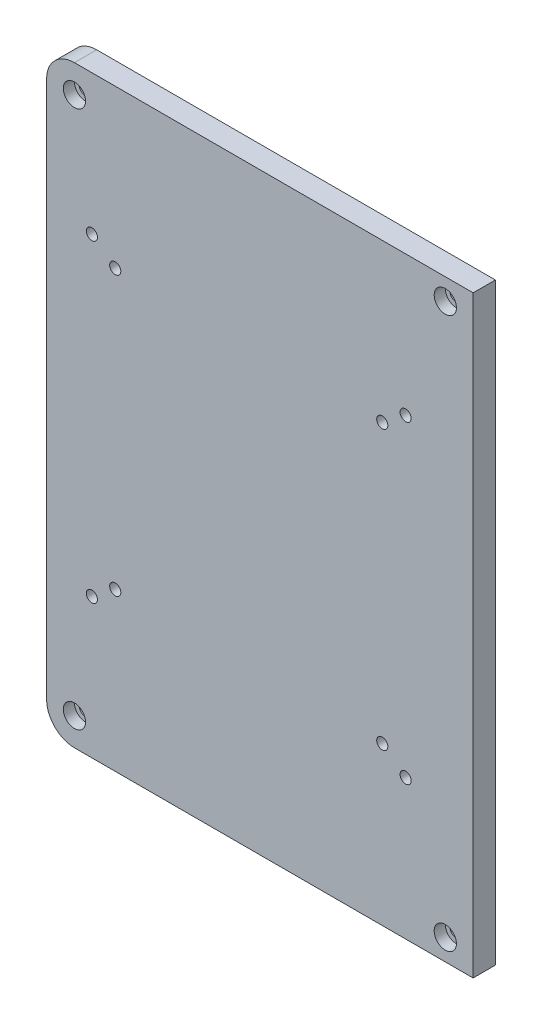
ISO-10303-21;
HEADER;
FILE_DESCRIPTION(('STEP AP214'),'2;1');
FILE_NAME('part.step','',(''),(''),'','','');
FILE_SCHEMA(('AUTOMOTIVE_DESIGN { 1 0 10303 214 1 1 1 1 }'));
ENDSEC;
DATA;
#1=APPLICATION_CONTEXT('core data for automotive mechanical design processes');
#2=APPLICATION_PROTOCOL_DEFINITION('international standard','automotive_design',2000,#1);
#3=PRODUCT_CONTEXT('',#1,'mechanical');
#4=PRODUCT('Part','Part','',(#3));
#5=PRODUCT_RELATED_PRODUCT_CATEGORY('part','',(#4));
#6=PRODUCT_DEFINITION_FORMATION('','',#4);
#7=PRODUCT_DEFINITION_CONTEXT('part definition',#1,'design');
#8=PRODUCT_DEFINITION('design','',#6,#7);
#9=PRODUCT_DEFINITION_SHAPE('','',#8);
#10=(LENGTH_UNIT() NAMED_UNIT(*) SI_UNIT(.MILLI.,.METRE.));
#11=(NAMED_UNIT(*) PLANE_ANGLE_UNIT() SI_UNIT($,.RADIAN.));
#12=(NAMED_UNIT(*) SI_UNIT($,.STERADIAN.) SOLID_ANGLE_UNIT());
#13=UNCERTAINTY_MEASURE_WITH_UNIT(LENGTH_MEASURE(1.E-05),#10,'distance_accuracy_value','');
#14=(GEOMETRIC_REPRESENTATION_CONTEXT(3) GLOBAL_UNCERTAINTY_ASSIGNED_CONTEXT((#13)) GLOBAL_UNIT_ASSIGNED_CONTEXT((#10,
#11,#12)) REPRESENTATION_CONTEXT('',''));
#15=CARTESIAN_POINT('',(0.,0.,0.));
#16=DIRECTION('',(0.,0.,1.));
#17=DIRECTION('',(1.,0.,0.));
#18=AXIS2_PLACEMENT_3D('',#15,#16,#17);
#19=CARTESIAN_POINT('',(-107.5,72.5,-4.));
#20=DIRECTION('',(0.,0.,1.));
#21=DIRECTION('',(1.,0.,0.));
#22=AXIS2_PLACEMENT_3D('',#19,#20,#21);
#23=CYLINDRICAL_SURFACE('',#22,1.75);
#24=CARTESIAN_POINT('',(-107.5,72.5,0.));
#25=DIRECTION('',(0.,0.,1.));
#26=DIRECTION('',(1.,0.,0.));
#27=AXIS2_PLACEMENT_3D('',#24,#25,#26);
#28=CIRCLE('',#27,1.75);
#29=CARTESIAN_POINT('',(-105.75,72.5,0.));
#30=VERTEX_POINT('',#29);
#31=EDGE_CURVE('E140',#30,#30,#28,.T.);
#32=ORIENTED_EDGE('',*,*,#31,.F.);
#33=EDGE_LOOP('',(#32));
#34=FACE_BOUND('',#33,.T.);
#35=CARTESIAN_POINT('',(-107.5,72.5,3.));
#36=DIRECTION('',(0.,0.,1.));
#37=DIRECTION('',(1.,0.,0.));
#38=AXIS2_PLACEMENT_3D('',#35,#36,#37);
#39=CIRCLE('',#38,1.75);
#40=CARTESIAN_POINT('',(-105.75,72.5,3.));
#41=VERTEX_POINT('',#40);
#42=EDGE_CURVE('E37',#41,#41,#39,.F.);
#43=ORIENTED_EDGE('',*,*,#42,.F.);
#44=EDGE_LOOP('',(#43));
#45=FACE_BOUND('',#44,.T.);
#46=ADVANCED_FACE('F33',(#34,#45),#23,.F.);
#47=CARTESIAN_POINT('',(-7.50000000000003,-74.25,-4.94974746830584));
#48=DIRECTION('',(0.,0.,1.));
#49=DIRECTION('',(1.,0.,0.));
#50=AXIS2_PLACEMENT_3D('',#47,#48,#49);
#51=CYLINDRICAL_SURFACE('',#50,1.75);
#52=CARTESIAN_POINT('',(-7.50000000000003,-74.25,0.));
#53=DIRECTION('',(0.,0.,1.));
#54=DIRECTION('',(1.,0.,0.));
#55=AXIS2_PLACEMENT_3D('',#52,#53,#54);
#56=CIRCLE('',#55,1.75);
#57=CARTESIAN_POINT('',(-5.75000000000003,-74.25,0.));
#58=VERTEX_POINT('',#57);
#59=EDGE_CURVE('E100',#58,#58,#56,.F.);
#60=ORIENTED_EDGE('',*,*,#59,.T.);
#61=EDGE_LOOP('',(#60));
#62=FACE_BOUND('',#61,.T.);
#63=CARTESIAN_POINT('',(-7.50000000000003,-74.25,3.));
#64=DIRECTION('',(0.,0.,1.));
#65=DIRECTION('',(1.,0.,0.));
#66=AXIS2_PLACEMENT_3D('',#63,#64,#65);
#67=CIRCLE('',#66,1.75);
#68=CARTESIAN_POINT('',(-5.75000000000003,-74.25,3.));
#69=VERTEX_POINT('',#68);
#70=EDGE_CURVE('E151',#69,#69,#67,.F.);
#71=ORIENTED_EDGE('',*,*,#70,.F.);
#72=EDGE_LOOP('',(#71));
#73=FACE_BOUND('',#72,.T.);
#74=ADVANCED_FACE('F239',(#62,#73),#51,.F.);
#75=CARTESIAN_POINT('',(-7.50000000000003,74.25,-4.94974746830584));
#76=DIRECTION('',(0.,0.,1.));
#77=DIRECTION('',(1.,0.,0.));
#78=AXIS2_PLACEMENT_3D('',#75,#76,#77);
#79=CYLINDRICAL_SURFACE('',#78,1.75);
#80=CARTESIAN_POINT('',(-7.50000000000003,74.25,0.));
#81=DIRECTION('',(0.,0.,1.));
#82=DIRECTION('',(1.,0.,0.));
#83=AXIS2_PLACEMENT_3D('',#80,#81,#82);
#84=CIRCLE('',#83,1.75);
#85=CARTESIAN_POINT('',(-5.75000000000003,74.25,0.));
#86=VERTEX_POINT('',#85);
#87=EDGE_CURVE('E147',#86,#86,#84,.F.);
#88=ORIENTED_EDGE('',*,*,#87,.T.);
#89=EDGE_LOOP('',(#88));
#90=FACE_BOUND('',#89,.T.);
#91=CARTESIAN_POINT('',(-7.50000000000003,74.25,3.));
#92=DIRECTION('',(0.,0.,1.));
#93=DIRECTION('',(1.,0.,0.));
#94=AXIS2_PLACEMENT_3D('',#91,#92,#93);
#95=CIRCLE('',#94,1.75);
#96=CARTESIAN_POINT('',(-5.75000000000003,74.25,3.));
#97=VERTEX_POINT('',#96);
#98=EDGE_CURVE('E149',#97,#97,#95,.F.);
#99=ORIENTED_EDGE('',*,*,#98,.F.);
#100=EDGE_LOOP('',(#99));
#101=FACE_BOUND('',#100,.T.);
#102=ADVANCED_FACE('F245',(#90,#101),#79,.F.);
#103=CARTESIAN_POINT('',(-107.5,-72.5,-4.));
#104=DIRECTION('',(0.,0.,1.));
#105=DIRECTION('',(1.,0.,0.));
#106=AXIS2_PLACEMENT_3D('',#103,#104,#105);
#107=CYLINDRICAL_SURFACE('',#106,1.75);
#108=CARTESIAN_POINT('',(-107.5,-72.5,0.));
#109=DIRECTION('',(0.,0.,1.));
#110=DIRECTION('',(1.,0.,0.));
#111=AXIS2_PLACEMENT_3D('',#108,#109,#110);
#112=CIRCLE('',#111,1.75);
#113=CARTESIAN_POINT('',(-105.75,-72.5,0.));
#114=VERTEX_POINT('',#113);
#115=EDGE_CURVE('E124',#114,#114,#112,.T.);
#116=ORIENTED_EDGE('',*,*,#115,.F.);
#117=EDGE_LOOP('',(#116));
#118=FACE_BOUND('',#117,.T.);
#119=CARTESIAN_POINT('',(-107.5,-72.5,3.));
#120=DIRECTION('',(0.,0.,1.));
#121=DIRECTION('',(1.,0.,0.));
#122=AXIS2_PLACEMENT_3D('',#119,#120,#121);
#123=CIRCLE('',#122,1.75);
#124=CARTESIAN_POINT('',(-105.75,-72.5,3.));
#125=VERTEX_POINT('',#124);
#126=EDGE_CURVE('E144',#125,#125,#123,.F.);
#127=ORIENTED_EDGE('',*,*,#126,.F.);
#128=EDGE_LOOP('',(#127));
#129=FACE_BOUND('',#128,.T.);
#130=ADVANCED_FACE('F252',(#118,#129),#107,.F.);
#131=CARTESIAN_POINT('',(-107.5,-72.5,6.));
#132=DIRECTION('',(0.,0.,-1.));
#133=DIRECTION('',(-1.,0.,0.));
#134=AXIS2_PLACEMENT_3D('',#131,#132,#133);
#135=CYLINDRICAL_SURFACE('',#134,7.5);
#136=CARTESIAN_POINT('',(-107.5,-72.5,0.));
#137=DIRECTION('',(0.,0.,1.));
#138=DIRECTION('',(1.,0.,0.));
#139=AXIS2_PLACEMENT_3D('',#136,#137,#138);
#140=CIRCLE('',#139,7.5);
#141=CARTESIAN_POINT('',(-115.,-72.5,0.));
#142=VERTEX_POINT('',#141);
#143=CARTESIAN_POINT('',(-107.5,-80.,0.));
#144=VERTEX_POINT('',#143);
#145=EDGE_CURVE('E121',#142,#144,#140,.T.);
#146=ORIENTED_EDGE('',*,*,#145,.T.);
#147=DIRECTION('',(0.,0.,-1.));
#148=VECTOR('',#147,1.);
#149=CARTESIAN_POINT('',(-107.5,-80.,6.));
#150=LINE('',#149,#148);
#151=CARTESIAN_POINT('',(-107.5,-80.,6.));
#152=VERTEX_POINT('',#151);
#153=EDGE_CURVE('E42',#152,#144,#150,.T.);
#154=ORIENTED_EDGE('',*,*,#153,.F.);
#155=CARTESIAN_POINT('',(-107.5,-72.5,6.));
#156=DIRECTION('',(0.,0.,1.));
#157=DIRECTION('',(1.,0.,0.));
#158=AXIS2_PLACEMENT_3D('',#155,#156,#157);
#159=CIRCLE('',#158,7.5);
#160=CARTESIAN_POINT('',(-115.,-72.5,6.));
#161=VERTEX_POINT('',#160);
#162=EDGE_CURVE('E109',#161,#152,#159,.T.);
#163=ORIENTED_EDGE('',*,*,#162,.F.);
#164=DIRECTION('',(0.,0.,-1.));
#165=VECTOR('',#164,1.);
#166=CARTESIAN_POINT('',(-115.,-72.5,6.));
#167=LINE('',#166,#165);
#168=EDGE_CURVE('E120',#161,#142,#167,.T.);
#169=ORIENTED_EDGE('',*,*,#168,.T.);
#170=EDGE_LOOP('',(#146,#154,#163,#169));
#171=FACE_BOUND('',#170,.T.);
#172=ADVANCED_FACE('F35',(#171),#135,.T.);
#173=CARTESIAN_POINT('',(-107.5,-80.,6.));
#174=DIRECTION('',(0.,1.,0.));
#175=DIRECTION('',(0.,0.,1.));
#176=AXIS2_PLACEMENT_3D('',#173,#174,#175);
#177=PLANE('',#176);
#178=DIRECTION('',(1.,0.,0.));
#179=VECTOR('',#178,1.);
#180=CARTESIAN_POINT('',(-107.5,-80.,0.));
#181=LINE('',#180,#179);
#182=CARTESIAN_POINT('',(0.,-80.,0.));
#183=VERTEX_POINT('',#182);
#184=EDGE_CURVE('E104',#144,#183,#181,.T.);
#185=ORIENTED_EDGE('',*,*,#184,.T.);
#186=DIRECTION('',(0.,0.,1.));
#187=VECTOR('',#186,1.);
#188=CARTESIAN_POINT('',(0.,-80.,-4.));
#189=LINE('',#188,#187);
#190=CARTESIAN_POINT('',(0.,-80.,6.));
#191=VERTEX_POINT('',#190);
#192=EDGE_CURVE('E50',#183,#191,#189,.T.);
#193=ORIENTED_EDGE('',*,*,#192,.T.);
#194=DIRECTION('',(1.,0.,0.));
#195=VECTOR('',#194,1.);
#196=CARTESIAN_POINT('',(-107.5,-80.,6.));
#197=LINE('',#196,#195);
#198=EDGE_CURVE('E86',#152,#191,#197,.T.);
#199=ORIENTED_EDGE('',*,*,#198,.F.);
#200=ORIENTED_EDGE('',*,*,#153,.T.);
#201=EDGE_LOOP('',(#185,#193,#199,#200));
#202=FACE_BOUND('',#201,.T.);
#203=ADVANCED_FACE('F103',(#202),#177,.F.);
#204=CARTESIAN_POINT('',(-107.5,80.,6.));
#205=DIRECTION('',(0.,-1.,0.));
#206=DIRECTION('',(0.,0.,-1.));
#207=AXIS2_PLACEMENT_3D('',#204,#205,#206);
#208=PLANE('',#207);
#209=DIRECTION('',(-1.,0.,0.));
#210=VECTOR('',#209,1.);
#211=CARTESIAN_POINT('',(-107.5,80.,6.));
#212=LINE('',#211,#210);
#213=CARTESIAN_POINT('',(0.,80.,6.));
#214=VERTEX_POINT('',#213);
#215=CARTESIAN_POINT('',(-107.5,80.,6.));
#216=VERTEX_POINT('',#215);
#217=EDGE_CURVE('E111',#214,#216,#212,.T.);
#218=ORIENTED_EDGE('',*,*,#217,.F.);
#219=DIRECTION('',(0.,0.,1.));
#220=VECTOR('',#219,1.);
#221=CARTESIAN_POINT('',(0.,80.,-4.));
#222=LINE('',#221,#220);
#223=CARTESIAN_POINT('',(0.,80.,0.));
#224=VERTEX_POINT('',#223);
#225=EDGE_CURVE('E98',#224,#214,#222,.T.);
#226=ORIENTED_EDGE('',*,*,#225,.F.);
#227=DIRECTION('',(-1.,0.,0.));
#228=VECTOR('',#227,1.);
#229=CARTESIAN_POINT('',(-107.5,80.,0.));
#230=LINE('',#229,#228);
#231=CARTESIAN_POINT('',(-107.5,80.,0.));
#232=VERTEX_POINT('',#231);
#233=EDGE_CURVE('E126',#224,#232,#230,.T.);
#234=ORIENTED_EDGE('',*,*,#233,.T.);
#235=DIRECTION('',(0.,0.,-1.));
#236=VECTOR('',#235,1.);
#237=CARTESIAN_POINT('',(-107.5,80.,6.));
#238=LINE('',#237,#236);
#239=EDGE_CURVE('E134',#216,#232,#238,.T.);
#240=ORIENTED_EDGE('',*,*,#239,.F.);
#241=EDGE_LOOP('',(#218,#226,#234,#240));
#242=FACE_BOUND('',#241,.T.);
#243=ADVANCED_FACE('F327',(#242),#208,.F.);
#244=CARTESIAN_POINT('',(-107.5,72.5,6.));
#245=DIRECTION('',(0.,0.,-1.));
#246=DIRECTION('',(-1.,0.,0.));
#247=AXIS2_PLACEMENT_3D('',#244,#245,#246);
#248=CYLINDRICAL_SURFACE('',#247,7.49999999999999);
#249=CARTESIAN_POINT('',(-107.5,72.5,0.));
#250=DIRECTION('',(0.,0.,1.));
#251=DIRECTION('',(1.,0.,0.));
#252=AXIS2_PLACEMENT_3D('',#249,#250,#251);
#253=CIRCLE('',#252,7.49999999999999);
#254=CARTESIAN_POINT('',(-115.,72.5,0.));
#255=VERTEX_POINT('',#254);
#256=EDGE_CURVE('E128',#232,#255,#253,.T.);
#257=ORIENTED_EDGE('',*,*,#256,.T.);
#258=DIRECTION('',(0.,0.,-1.));
#259=VECTOR('',#258,1.);
#260=CARTESIAN_POINT('',(-115.,72.5,6.));
#261=LINE('',#260,#259);
#262=CARTESIAN_POINT('',(-115.,72.5,6.));
#263=VERTEX_POINT('',#262);
#264=EDGE_CURVE('E132',#263,#255,#261,.T.);
#265=ORIENTED_EDGE('',*,*,#264,.F.);
#266=CARTESIAN_POINT('',(-107.5,72.5,6.));
#267=DIRECTION('',(0.,0.,1.));
#268=DIRECTION('',(1.,0.,0.));
#269=AXIS2_PLACEMENT_3D('',#266,#267,#268);
#270=CIRCLE('',#269,7.49999999999999);
#271=EDGE_CURVE('E113',#216,#263,#270,.T.);
#272=ORIENTED_EDGE('',*,*,#271,.F.);
#273=ORIENTED_EDGE('',*,*,#239,.T.);
#274=EDGE_LOOP('',(#257,#265,#272,#273));
#275=FACE_BOUND('',#274,.T.);
#276=ADVANCED_FACE('F233',(#275),#248,.T.);
#277=CARTESIAN_POINT('',(-115.,72.5,6.));
#278=DIRECTION('',(1.,0.,0.));
#279=DIRECTION('',(0.,0.,-1.));
#280=AXIS2_PLACEMENT_3D('',#277,#278,#279);
#281=PLANE('',#280);
#282=DIRECTION('',(0.,-1.,0.));
#283=VECTOR('',#282,1.);
#284=CARTESIAN_POINT('',(-115.,72.5,0.));
#285=LINE('',#284,#283);
#286=EDGE_CURVE('E79',#255,#142,#285,.T.);
#287=ORIENTED_EDGE('',*,*,#286,.T.);
#288=ORIENTED_EDGE('',*,*,#168,.F.);
#289=DIRECTION('',(0.,-1.,0.));
#290=VECTOR('',#289,1.);
#291=CARTESIAN_POINT('',(-115.,72.5,6.));
#292=LINE('',#291,#290);
#293=EDGE_CURVE('E58',#263,#161,#292,.T.);
#294=ORIENTED_EDGE('',*,*,#293,.F.);
#295=ORIENTED_EDGE('',*,*,#264,.T.);
#296=EDGE_LOOP('',(#287,#288,#294,#295));
#297=FACE_BOUND('',#296,.T.);
#298=ADVANCED_FACE('F224',(#297),#281,.F.);
#299=CARTESIAN_POINT('',(-107.5,-72.5,6.));
#300=DIRECTION('',(0.,0.,1.));
#301=DIRECTION('',(1.,0.,0.));
#302=AXIS2_PLACEMENT_3D('',#299,#300,#301);
#303=PLANE('',#302);
#304=CARTESIAN_POINT('',(-7.50000000000003,-74.25,6.));
#305=DIRECTION('',(0.,0.,1.));
#306=DIRECTION('',(1.,0.,0.));
#307=AXIS2_PLACEMENT_3D('',#304,#305,#306);
#308=CIRCLE('',#307,3.);
#309=CARTESIAN_POINT('',(-4.50000000000003,-74.25,6.));
#310=VERTEX_POINT('',#309);
#311=EDGE_CURVE('E474',#310,#310,#308,.T.);
#312=ORIENTED_EDGE('',*,*,#311,.F.);
#313=EDGE_LOOP('',(#312));
#314=FACE_BOUND('',#313,.T.);
#315=CARTESIAN_POINT('',(-7.50000000000003,74.25,6.));
#316=DIRECTION('',(0.,0.,1.));
#317=DIRECTION('',(1.,0.,0.));
#318=AXIS2_PLACEMENT_3D('',#315,#316,#317);
#319=CIRCLE('',#318,3.);
#320=CARTESIAN_POINT('',(-4.50000000000003,74.25,6.));
#321=VERTEX_POINT('',#320);
#322=EDGE_CURVE('E466',#321,#321,#319,.T.);
#323=ORIENTED_EDGE('',*,*,#322,.F.);
#324=EDGE_LOOP('',(#323));
#325=FACE_BOUND('',#324,.T.);
#326=CARTESIAN_POINT('',(-107.5,72.5,6.));
#327=DIRECTION('',(0.,0.,1.));
#328=DIRECTION('',(1.,0.,0.));
#329=AXIS2_PLACEMENT_3D('',#326,#327,#328);
#330=CIRCLE('',#329,3.00000000000001);
#331=CARTESIAN_POINT('',(-104.5,72.5,6.));
#332=VERTEX_POINT('',#331);
#333=EDGE_CURVE('E464',#332,#332,#330,.T.);
#334=ORIENTED_EDGE('',*,*,#333,.F.);
#335=EDGE_LOOP('',(#334));
#336=FACE_BOUND('',#335,.T.);
#337=CARTESIAN_POINT('',(-107.5,-72.5,6.));
#338=DIRECTION('',(0.,0.,1.));
#339=DIRECTION('',(1.,0.,0.));
#340=AXIS2_PLACEMENT_3D('',#337,#338,#339);
#341=CIRCLE('',#340,3.00000000000001);
#342=CARTESIAN_POINT('',(-104.5,-72.5,6.));
#343=VERTEX_POINT('',#342);
#344=EDGE_CURVE('E157',#343,#343,#341,.T.);
#345=ORIENTED_EDGE('',*,*,#344,.F.);
#346=EDGE_LOOP('',(#345));
#347=FACE_BOUND('',#346,.T.);
#348=DIRECTION('',(0.,-1.,0.));
#349=VECTOR('',#348,1.);
#350=CARTESIAN_POINT('',(0.,80.,6.));
#351=LINE('',#350,#349);
#352=EDGE_CURVE('E95',#214,#191,#351,.T.);
#353=ORIENTED_EDGE('',*,*,#352,.F.);
#354=ORIENTED_EDGE('',*,*,#217,.T.);
#355=ORIENTED_EDGE('',*,*,#271,.T.);
#356=ORIENTED_EDGE('',*,*,#293,.T.);
#357=ORIENTED_EDGE('',*,*,#162,.T.);
#358=ORIENTED_EDGE('',*,*,#198,.T.);
#359=EDGE_LOOP('',(#353,#354,#355,#356,#357,#358));
#360=FACE_BOUND('',#359,.T.);
#361=CARTESIAN_POINT('',(-102.8,-42.3,6.));
#362=DIRECTION('',(0.,0.,1.));
#363=DIRECTION('',(1.,0.,0.));
#364=AXIS2_PLACEMENT_3D('',#361,#362,#363);
#365=CIRCLE('',#364,1.5);
#366=CARTESIAN_POINT('',(-101.3,-42.3,6.));
#367=VERTEX_POINT('',#366);
#368=EDGE_CURVE('E178',#367,#367,#365,.T.);
#369=ORIENTED_EDGE('',*,*,#368,.F.);
#370=EDGE_LOOP('',(#369));
#371=FACE_BOUND('',#370,.T.);
#372=CARTESIAN_POINT('',(-18.2,-42.3,6.));
#373=DIRECTION('',(0.,0.,1.));
#374=DIRECTION('',(1.,0.,0.));
#375=AXIS2_PLACEMENT_3D('',#372,#373,#374);
#376=CIRCLE('',#375,1.5);
#377=CARTESIAN_POINT('',(-16.7,-42.3,6.));
#378=VERTEX_POINT('',#377);
#379=EDGE_CURVE('E184',#378,#378,#376,.T.);
#380=ORIENTED_EDGE('',*,*,#379,.F.);
#381=EDGE_LOOP('',(#380));
#382=FACE_BOUND('',#381,.T.);
#383=CARTESIAN_POINT('',(-18.2,42.3,6.));
#384=DIRECTION('',(0.,0.,1.));
#385=DIRECTION('',(1.,0.,0.));
#386=AXIS2_PLACEMENT_3D('',#383,#384,#385);
#387=CIRCLE('',#386,1.5);
#388=CARTESIAN_POINT('',(-16.7,42.3,6.));
#389=VERTEX_POINT('',#388);
#390=EDGE_CURVE('E172',#389,#389,#387,.T.);
#391=ORIENTED_EDGE('',*,*,#390,.F.);
#392=EDGE_LOOP('',(#391));
#393=FACE_BOUND('',#392,.T.);
#394=CARTESIAN_POINT('',(-102.8,42.3,6.));
#395=DIRECTION('',(0.,0.,1.));
#396=DIRECTION('',(1.,0.,0.));
#397=AXIS2_PLACEMENT_3D('',#394,#395,#396);
#398=CIRCLE('',#397,1.5);
#399=CARTESIAN_POINT('',(-101.3,42.3,6.));
#400=VERTEX_POINT('',#399);
#401=EDGE_CURVE('E177',#400,#400,#398,.T.);
#402=ORIENTED_EDGE('',*,*,#401,.F.);
#403=EDGE_LOOP('',(#402));
#404=FACE_BOUND('',#403,.T.);
#405=CARTESIAN_POINT('',(-96.5,-37.5,6.));
#406=DIRECTION('',(0.,0.,1.));
#407=DIRECTION('',(1.,0.,0.));
#408=AXIS2_PLACEMENT_3D('',#405,#406,#407);
#409=CIRCLE('',#408,1.5);
#410=CARTESIAN_POINT('',(-95.,-37.5,6.));
#411=VERTEX_POINT('',#410);
#412=EDGE_CURVE('E202',#411,#411,#409,.T.);
#413=ORIENTED_EDGE('',*,*,#412,.F.);
#414=EDGE_LOOP('',(#413));
#415=FACE_BOUND('',#414,.T.);
#416=CARTESIAN_POINT('',(-24.5,37.5,6.));
#417=DIRECTION('',(0.,0.,1.));
#418=DIRECTION('',(1.,0.,0.));
#419=AXIS2_PLACEMENT_3D('',#416,#417,#418);
#420=CIRCLE('',#419,1.5);
#421=CARTESIAN_POINT('',(-23.,37.5,6.));
#422=VERTEX_POINT('',#421);
#423=EDGE_CURVE('E208',#422,#422,#420,.T.);
#424=ORIENTED_EDGE('',*,*,#423,.F.);
#425=EDGE_LOOP('',(#424));
#426=FACE_BOUND('',#425,.T.);
#427=CARTESIAN_POINT('',(-24.5,-37.5,6.));
#428=DIRECTION('',(0.,0.,1.));
#429=DIRECTION('',(1.,0.,0.));
#430=AXIS2_PLACEMENT_3D('',#427,#428,#429);
#431=CIRCLE('',#430,1.5);
#432=CARTESIAN_POINT('',(-23.,-37.5,6.));
#433=VERTEX_POINT('',#432);
#434=EDGE_CURVE('E195',#433,#433,#431,.T.);
#435=ORIENTED_EDGE('',*,*,#434,.F.);
#436=EDGE_LOOP('',(#435));
#437=FACE_BOUND('',#436,.T.);
#438=CARTESIAN_POINT('',(-96.5,37.5,6.));
#439=DIRECTION('',(0.,0.,1.));
#440=DIRECTION('',(1.,0.,0.));
#441=AXIS2_PLACEMENT_3D('',#438,#439,#440);
#442=CIRCLE('',#441,1.5);
#443=CARTESIAN_POINT('',(-95.,37.5,6.));
#444=VERTEX_POINT('',#443);
#445=EDGE_CURVE('E201',#444,#444,#442,.T.);
#446=ORIENTED_EDGE('',*,*,#445,.F.);
#447=EDGE_LOOP('',(#446));
#448=FACE_BOUND('',#447,.T.);
#449=ADVANCED_FACE('F106',(#314,#325,#336,#347,#360,#371,#382,#393,#404,#415,#426,#437,#448),
#303,.T.);
#450=CARTESIAN_POINT('',(-107.5,-72.5,0.));
#451=DIRECTION('',(0.,0.,1.));
#452=DIRECTION('',(1.,0.,0.));
#453=AXIS2_PLACEMENT_3D('',#450,#451,#452);
#454=PLANE('',#453);
#455=ORIENTED_EDGE('',*,*,#87,.F.);
#456=EDGE_LOOP('',(#455));
#457=FACE_BOUND('',#456,.T.);
#458=ORIENTED_EDGE('',*,*,#59,.F.);
#459=EDGE_LOOP('',(#458));
#460=FACE_BOUND('',#459,.T.);
#461=CARTESIAN_POINT('',(-102.8,-42.3,0.));
#462=DIRECTION('',(0.,0.,1.));
#463=DIRECTION('',(1.,0.,0.));
#464=AXIS2_PLACEMENT_3D('',#461,#462,#463);
#465=CIRCLE('',#464,1.5);
#466=CARTESIAN_POINT('',(-101.3,-42.3,0.));
#467=VERTEX_POINT('',#466);
#468=EDGE_CURVE('E174',#467,#467,#465,.T.);
#469=ORIENTED_EDGE('',*,*,#468,.T.);
#470=EDGE_LOOP('',(#469));
#471=FACE_BOUND('',#470,.T.);
#472=CARTESIAN_POINT('',(-18.2,-42.3,0.));
#473=DIRECTION('',(0.,0.,1.));
#474=DIRECTION('',(1.,0.,0.));
#475=AXIS2_PLACEMENT_3D('',#472,#473,#474);
#476=CIRCLE('',#475,1.5);
#477=CARTESIAN_POINT('',(-16.7,-42.3,0.));
#478=VERTEX_POINT('',#477);
#479=EDGE_CURVE('E181',#478,#478,#476,.T.);
#480=ORIENTED_EDGE('',*,*,#479,.T.);
#481=EDGE_LOOP('',(#480));
#482=FACE_BOUND('',#481,.T.);
#483=CARTESIAN_POINT('',(-18.2,42.3,0.));
#484=DIRECTION('',(0.,0.,1.));
#485=DIRECTION('',(1.,0.,0.));
#486=AXIS2_PLACEMENT_3D('',#483,#484,#485);
#487=CIRCLE('',#486,1.5);
#488=CARTESIAN_POINT('',(-16.7,42.3,0.));
#489=VERTEX_POINT('',#488);
#490=EDGE_CURVE('E187',#489,#489,#487,.T.);
#491=ORIENTED_EDGE('',*,*,#490,.T.);
#492=EDGE_LOOP('',(#491));
#493=FACE_BOUND('',#492,.T.);
#494=CARTESIAN_POINT('',(-102.8,42.3,0.));
#495=DIRECTION('',(0.,0.,1.));
#496=DIRECTION('',(1.,0.,0.));
#497=AXIS2_PLACEMENT_3D('',#494,#495,#496);
#498=CIRCLE('',#497,1.5);
#499=CARTESIAN_POINT('',(-101.3,42.3,0.));
#500=VERTEX_POINT('',#499);
#501=EDGE_CURVE('E192',#500,#500,#498,.T.);
#502=ORIENTED_EDGE('',*,*,#501,.T.);
#503=EDGE_LOOP('',(#502));
#504=FACE_BOUND('',#503,.T.);
#505=CARTESIAN_POINT('',(-96.5,-37.5,0.));
#506=DIRECTION('',(0.,0.,1.));
#507=DIRECTION('',(1.,0.,0.));
#508=AXIS2_PLACEMENT_3D('',#505,#506,#507);
#509=CIRCLE('',#508,1.5);
#510=CARTESIAN_POINT('',(-95.,-37.5,0.));
#511=VERTEX_POINT('',#510);
#512=EDGE_CURVE('E198',#511,#511,#509,.T.);
#513=ORIENTED_EDGE('',*,*,#512,.T.);
#514=EDGE_LOOP('',(#513));
#515=FACE_BOUND('',#514,.T.);
#516=CARTESIAN_POINT('',(-24.5,37.5,0.));
#517=DIRECTION('',(0.,0.,1.));
#518=DIRECTION('',(1.,0.,0.));
#519=AXIS2_PLACEMENT_3D('',#516,#517,#518);
#520=CIRCLE('',#519,1.5);
#521=CARTESIAN_POINT('',(-23.,37.5,0.));
#522=VERTEX_POINT('',#521);
#523=EDGE_CURVE('E205',#522,#522,#520,.T.);
#524=ORIENTED_EDGE('',*,*,#523,.T.);
#525=EDGE_LOOP('',(#524));
#526=FACE_BOUND('',#525,.T.);
#527=CARTESIAN_POINT('',(-24.5,-37.5,0.));
#528=DIRECTION('',(0.,0.,1.));
#529=DIRECTION('',(1.,0.,0.));
#530=AXIS2_PLACEMENT_3D('',#527,#528,#529);
#531=CIRCLE('',#530,1.5);
#532=CARTESIAN_POINT('',(-23.,-37.5,0.));
#533=VERTEX_POINT('',#532);
#534=EDGE_CURVE('E211',#533,#533,#531,.T.);
#535=ORIENTED_EDGE('',*,*,#534,.T.);
#536=EDGE_LOOP('',(#535));
#537=FACE_BOUND('',#536,.T.);
#538=CARTESIAN_POINT('',(-96.5,37.5,0.));
#539=DIRECTION('',(0.,0.,1.));
#540=DIRECTION('',(1.,0.,0.));
#541=AXIS2_PLACEMENT_3D('',#538,#539,#540);
#542=CIRCLE('',#541,1.5);
#543=CARTESIAN_POINT('',(-95.,37.5,0.));
#544=VERTEX_POINT('',#543);
#545=EDGE_CURVE('E142',#544,#544,#542,.T.);
#546=ORIENTED_EDGE('',*,*,#545,.T.);
#547=EDGE_LOOP('',(#546));
#548=FACE_BOUND('',#547,.T.);
#549=ORIENTED_EDGE('',*,*,#31,.T.);
#550=EDGE_LOOP('',(#549));
#551=FACE_BOUND('',#550,.T.);
#552=ORIENTED_EDGE('',*,*,#115,.T.);
#553=EDGE_LOOP('',(#552));
#554=FACE_BOUND('',#553,.T.);
#555=ORIENTED_EDGE('',*,*,#233,.F.);
#556=DIRECTION('',(0.,-1.,0.));
#557=VECTOR('',#556,1.);
#558=CARTESIAN_POINT('',(0.,-72.5,0.));
#559=LINE('',#558,#557);
#560=EDGE_CURVE('E11',#224,#183,#559,.T.);
#561=ORIENTED_EDGE('',*,*,#560,.T.);
#562=ORIENTED_EDGE('',*,*,#184,.F.);
#563=ORIENTED_EDGE('',*,*,#145,.F.);
#564=ORIENTED_EDGE('',*,*,#286,.F.);
#565=ORIENTED_EDGE('',*,*,#256,.F.);
#566=EDGE_LOOP('',(#555,#561,#562,#563,#564,#565));
#567=FACE_BOUND('',#566,.T.);
#568=ADVANCED_FACE('F223',(#457,#460,#471,#482,#493,#504,#515,#526,#537,#548,#551,#554,#567),
#454,.F.);
#569=CARTESIAN_POINT('',(-96.5,37.5,0.));
#570=DIRECTION('',(0.,0.,1.));
#571=DIRECTION('',(1.,0.,0.));
#572=AXIS2_PLACEMENT_3D('',#569,#570,#571);
#573=CYLINDRICAL_SURFACE('',#572,1.5);
#574=ORIENTED_EDGE('',*,*,#545,.F.);
#575=EDGE_LOOP('',(#574));
#576=FACE_BOUND('',#575,.T.);
#577=ORIENTED_EDGE('',*,*,#445,.T.);
#578=EDGE_LOOP('',(#577));
#579=FACE_BOUND('',#578,.T.);
#580=ADVANCED_FACE('F220',(#576,#579),#573,.F.);
#581=CARTESIAN_POINT('',(-24.5,-37.5,0.));
#582=DIRECTION('',(0.,0.,1.));
#583=DIRECTION('',(1.,0.,0.));
#584=AXIS2_PLACEMENT_3D('',#581,#582,#583);
#585=CYLINDRICAL_SURFACE('',#584,1.5);
#586=ORIENTED_EDGE('',*,*,#534,.F.);
#587=EDGE_LOOP('',(#586));
#588=FACE_BOUND('',#587,.T.);
#589=ORIENTED_EDGE('',*,*,#434,.T.);
#590=EDGE_LOOP('',(#589));
#591=FACE_BOUND('',#590,.T.);
#592=ADVANCED_FACE('F305',(#588,#591),#585,.F.);
#593=CARTESIAN_POINT('',(-24.5,37.5,0.));
#594=DIRECTION('',(0.,0.,1.));
#595=DIRECTION('',(1.,0.,0.));
#596=AXIS2_PLACEMENT_3D('',#593,#594,#595);
#597=CYLINDRICAL_SURFACE('',#596,1.5);
#598=ORIENTED_EDGE('',*,*,#523,.F.);
#599=EDGE_LOOP('',(#598));
#600=FACE_BOUND('',#599,.T.);
#601=ORIENTED_EDGE('',*,*,#423,.T.);
#602=EDGE_LOOP('',(#601));
#603=FACE_BOUND('',#602,.T.);
#604=ADVANCED_FACE('F302',(#600,#603),#597,.F.);
#605=CARTESIAN_POINT('',(-96.5,-37.5,0.));
#606=DIRECTION('',(0.,0.,1.));
#607=DIRECTION('',(1.,0.,0.));
#608=AXIS2_PLACEMENT_3D('',#605,#606,#607);
#609=CYLINDRICAL_SURFACE('',#608,1.5);
#610=ORIENTED_EDGE('',*,*,#512,.F.);
#611=EDGE_LOOP('',(#610));
#612=FACE_BOUND('',#611,.T.);
#613=ORIENTED_EDGE('',*,*,#412,.T.);
#614=EDGE_LOOP('',(#613));
#615=FACE_BOUND('',#614,.T.);
#616=ADVANCED_FACE('F298',(#612,#615),#609,.F.);
#617=CARTESIAN_POINT('',(-102.8,42.3,0.));
#618=DIRECTION('',(0.,0.,1.));
#619=DIRECTION('',(1.,0.,0.));
#620=AXIS2_PLACEMENT_3D('',#617,#618,#619);
#621=CYLINDRICAL_SURFACE('',#620,1.5);
#622=ORIENTED_EDGE('',*,*,#501,.F.);
#623=EDGE_LOOP('',(#622));
#624=FACE_BOUND('',#623,.T.);
#625=ORIENTED_EDGE('',*,*,#401,.T.);
#626=EDGE_LOOP('',(#625));
#627=FACE_BOUND('',#626,.T.);
#628=ADVANCED_FACE('F294',(#624,#627),#621,.F.);
#629=CARTESIAN_POINT('',(-18.2,42.3,0.));
#630=DIRECTION('',(0.,0.,1.));
#631=DIRECTION('',(1.,0.,0.));
#632=AXIS2_PLACEMENT_3D('',#629,#630,#631);
#633=CYLINDRICAL_SURFACE('',#632,1.5);
#634=ORIENTED_EDGE('',*,*,#490,.F.);
#635=EDGE_LOOP('',(#634));
#636=FACE_BOUND('',#635,.T.);
#637=ORIENTED_EDGE('',*,*,#390,.T.);
#638=EDGE_LOOP('',(#637));
#639=FACE_BOUND('',#638,.T.);
#640=ADVANCED_FACE('F290',(#636,#639),#633,.F.);
#641=CARTESIAN_POINT('',(-18.2,-42.3,0.));
#642=DIRECTION('',(0.,0.,1.));
#643=DIRECTION('',(1.,0.,0.));
#644=AXIS2_PLACEMENT_3D('',#641,#642,#643);
#645=CYLINDRICAL_SURFACE('',#644,1.5);
#646=ORIENTED_EDGE('',*,*,#479,.F.);
#647=EDGE_LOOP('',(#646));
#648=FACE_BOUND('',#647,.T.);
#649=ORIENTED_EDGE('',*,*,#379,.T.);
#650=EDGE_LOOP('',(#649));
#651=FACE_BOUND('',#650,.T.);
#652=ADVANCED_FACE('F286',(#648,#651),#645,.F.);
#653=CARTESIAN_POINT('',(-102.8,-42.3,0.));
#654=DIRECTION('',(0.,0.,1.));
#655=DIRECTION('',(1.,0.,0.));
#656=AXIS2_PLACEMENT_3D('',#653,#654,#655);
#657=CYLINDRICAL_SURFACE('',#656,1.5);
#658=ORIENTED_EDGE('',*,*,#468,.F.);
#659=EDGE_LOOP('',(#658));
#660=FACE_BOUND('',#659,.T.);
#661=ORIENTED_EDGE('',*,*,#368,.T.);
#662=EDGE_LOOP('',(#661));
#663=FACE_BOUND('',#662,.T.);
#664=ADVANCED_FACE('F278',(#660,#663),#657,.F.);
#665=CARTESIAN_POINT('',(0.,80.,-4.));
#666=DIRECTION('',(-1.,0.,0.));
#667=DIRECTION('',(0.,-1.,0.));
#668=AXIS2_PLACEMENT_3D('',#665,#666,#667);
#669=PLANE('',#668);
#670=ORIENTED_EDGE('',*,*,#225,.T.);
#671=ORIENTED_EDGE('',*,*,#352,.T.);
#672=ORIENTED_EDGE('',*,*,#192,.F.);
#673=ORIENTED_EDGE('',*,*,#560,.F.);
#674=EDGE_LOOP('',(#670,#671,#672,#673));
#675=FACE_BOUND('',#674,.T.);
#676=ADVANCED_FACE('F96',(#675),#669,.F.);
#677=CARTESIAN_POINT('',(-107.5,-72.5,3.));
#678=DIRECTION('',(0.,0.,1.));
#679=DIRECTION('',(1.,0.,0.));
#680=AXIS2_PLACEMENT_3D('',#677,#678,#679);
#681=PLANE('',#680);
#682=CARTESIAN_POINT('',(-107.5,-72.5,3.));
#683=DIRECTION('',(0.,0.,1.));
#684=DIRECTION('',(1.,0.,0.));
#685=AXIS2_PLACEMENT_3D('',#682,#683,#684);
#686=CIRCLE('',#685,3.00000000000001);
#687=CARTESIAN_POINT('',(-104.5,-72.5,3.));
#688=VERTEX_POINT('',#687);
#689=EDGE_CURVE('E148',#688,#688,#686,.T.);
#690=ORIENTED_EDGE('',*,*,#689,.T.);
#691=EDGE_LOOP('',(#690));
#692=FACE_BOUND('',#691,.T.);
#693=ORIENTED_EDGE('',*,*,#126,.T.);
#694=EDGE_LOOP('',(#693));
#695=FACE_BOUND('',#694,.T.);
#696=ADVANCED_FACE('F266',(#692,#695),#681,.T.);
#697=CARTESIAN_POINT('',(-107.5,-72.5,3.));
#698=DIRECTION('',(0.,0.,1.));
#699=DIRECTION('',(1.,0.,0.));
#700=AXIS2_PLACEMENT_3D('',#697,#698,#699);
#701=CYLINDRICAL_SURFACE('',#700,3.00000000000001);
#702=ORIENTED_EDGE('',*,*,#689,.F.);
#703=EDGE_LOOP('',(#702));
#704=FACE_BOUND('',#703,.T.);
#705=ORIENTED_EDGE('',*,*,#344,.T.);
#706=EDGE_LOOP('',(#705));
#707=FACE_BOUND('',#706,.T.);
#708=ADVANCED_FACE('F268',(#704,#707),#701,.F.);
#709=CARTESIAN_POINT('',(-7.50000000000003,74.25,3.));
#710=DIRECTION('',(0.,0.,1.));
#711=DIRECTION('',(1.,0.,0.));
#712=AXIS2_PLACEMENT_3D('',#709,#710,#711);
#713=PLANE('',#712);
#714=CARTESIAN_POINT('',(-7.50000000000003,74.25,3.));
#715=DIRECTION('',(0.,0.,1.));
#716=DIRECTION('',(1.,0.,0.));
#717=AXIS2_PLACEMENT_3D('',#714,#715,#716);
#718=CIRCLE('',#717,3.);
#719=CARTESIAN_POINT('',(-4.50000000000003,74.25,3.));
#720=VERTEX_POINT('',#719);
#721=EDGE_CURVE('E471',#720,#720,#718,.T.);
#722=ORIENTED_EDGE('',*,*,#721,.T.);
#723=EDGE_LOOP('',(#722));
#724=FACE_BOUND('',#723,.T.);
#725=ORIENTED_EDGE('',*,*,#98,.T.);
#726=EDGE_LOOP('',(#725));
#727=FACE_BOUND('',#726,.T.);
#728=ADVANCED_FACE('F275',(#724,#727),#713,.T.);
#729=CARTESIAN_POINT('',(-7.50000000000003,74.25,3.));
#730=DIRECTION('',(0.,0.,1.));
#731=DIRECTION('',(1.,0.,0.));
#732=AXIS2_PLACEMENT_3D('',#729,#730,#731);
#733=CYLINDRICAL_SURFACE('',#732,3.);
#734=ORIENTED_EDGE('',*,*,#721,.F.);
#735=EDGE_LOOP('',(#734));
#736=FACE_BOUND('',#735,.T.);
#737=ORIENTED_EDGE('',*,*,#322,.T.);
#738=EDGE_LOOP('',(#737));
#739=FACE_BOUND('',#738,.T.);
#740=ADVANCED_FACE('F407',(#736,#739),#733,.F.);
#741=CARTESIAN_POINT('',(-7.50000000000003,-74.25,3.));
#742=DIRECTION('',(0.,0.,1.));
#743=DIRECTION('',(1.,0.,0.));
#744=AXIS2_PLACEMENT_3D('',#741,#742,#743);
#745=PLANE('',#744);
#746=CARTESIAN_POINT('',(-7.50000000000003,-74.25,3.));
#747=DIRECTION('',(0.,0.,1.));
#748=DIRECTION('',(1.,0.,0.));
#749=AXIS2_PLACEMENT_3D('',#746,#747,#748);
#750=CIRCLE('',#749,3.);
#751=CARTESIAN_POINT('',(-4.50000000000003,-74.25,3.));
#752=VERTEX_POINT('',#751);
#753=EDGE_CURVE('E152',#752,#752,#750,.T.);
#754=ORIENTED_EDGE('',*,*,#753,.T.);
#755=EDGE_LOOP('',(#754));
#756=FACE_BOUND('',#755,.T.);
#757=ORIENTED_EDGE('',*,*,#70,.T.);
#758=EDGE_LOOP('',(#757));
#759=FACE_BOUND('',#758,.T.);
#760=ADVANCED_FACE('F417',(#756,#759),#745,.T.);
#761=CARTESIAN_POINT('',(-7.50000000000003,-74.25,3.));
#762=DIRECTION('',(0.,0.,1.));
#763=DIRECTION('',(1.,0.,0.));
#764=AXIS2_PLACEMENT_3D('',#761,#762,#763);
#765=CYLINDRICAL_SURFACE('',#764,3.);
#766=ORIENTED_EDGE('',*,*,#753,.F.);
#767=EDGE_LOOP('',(#766));
#768=FACE_BOUND('',#767,.T.);
#769=ORIENTED_EDGE('',*,*,#311,.T.);
#770=EDGE_LOOP('',(#769));
#771=FACE_BOUND('',#770,.T.);
#772=ADVANCED_FACE('F427',(#768,#771),#765,.F.);
#773=CARTESIAN_POINT('',(-107.5,72.5,3.));
#774=DIRECTION('',(0.,0.,1.));
#775=DIRECTION('',(1.,0.,0.));
#776=AXIS2_PLACEMENT_3D('',#773,#774,#775);
#777=PLANE('',#776);
#778=CARTESIAN_POINT('',(-107.5,72.5,3.));
#779=DIRECTION('',(0.,0.,1.));
#780=DIRECTION('',(1.,0.,0.));
#781=AXIS2_PLACEMENT_3D('',#778,#779,#780);
#782=CIRCLE('',#781,3.00000000000001);
#783=CARTESIAN_POINT('',(-104.5,72.5,3.));
#784=VERTEX_POINT('',#783);
#785=EDGE_CURVE('E461',#784,#784,#782,.T.);
#786=ORIENTED_EDGE('',*,*,#785,.T.);
#787=EDGE_LOOP('',(#786));
#788=FACE_BOUND('',#787,.T.);
#789=ORIENTED_EDGE('',*,*,#42,.T.);
#790=EDGE_LOOP('',(#789));
#791=FACE_BOUND('',#790,.T.);
#792=ADVANCED_FACE('F437',(#788,#791),#777,.T.);
#793=CARTESIAN_POINT('',(-107.5,72.5,3.));
#794=DIRECTION('',(0.,0.,1.));
#795=DIRECTION('',(1.,0.,0.));
#796=AXIS2_PLACEMENT_3D('',#793,#794,#795);
#797=CYLINDRICAL_SURFACE('',#796,3.00000000000001);
#798=ORIENTED_EDGE('',*,*,#785,.F.);
#799=EDGE_LOOP('',(#798));
#800=FACE_BOUND('',#799,.T.);
#801=ORIENTED_EDGE('',*,*,#333,.T.);
#802=EDGE_LOOP('',(#801));
#803=FACE_BOUND('',#802,.T.);
#804=ADVANCED_FACE('F281',(#800,#803),#797,.F.);
#805=CLOSED_SHELL('',(#46,#74,#102,#130,#172,#203,#243,#276,#298,#449,#568,#580,#592,#604,#616,
#628,#640,#652,#664,#676,#696,#708,#728,#740,#760,#772,#792,#804));
#806=MANIFOLD_SOLID_BREP('B2',#805);
#807=ADVANCED_BREP_SHAPE_REPRESENTATION('',(#18,#806),#14);
#808=SHAPE_DEFINITION_REPRESENTATION(#9,#807);
ENDSEC;
END-ISO-10303-21;
